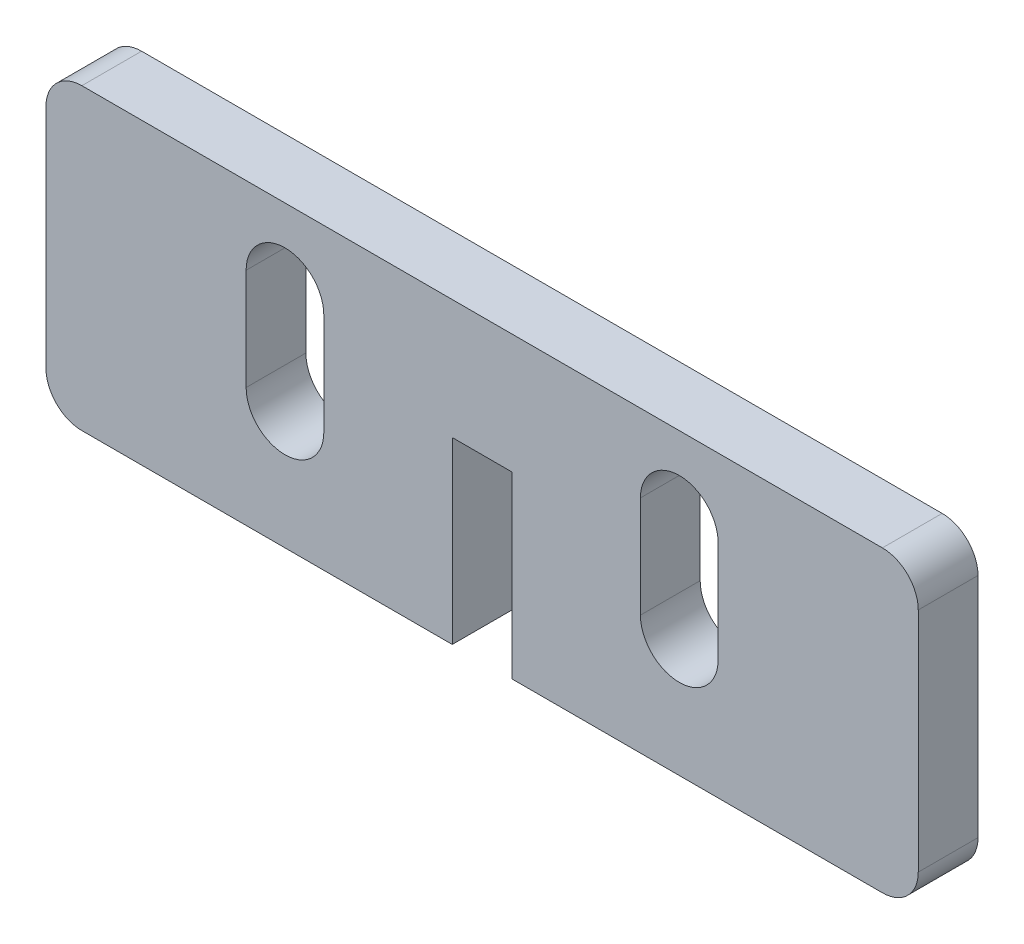
ISO-10303-21;
HEADER;
FILE_DESCRIPTION(('STEP AP214'),'2;1');
FILE_NAME('part.step','',(''),(''),'','','');
FILE_SCHEMA(('AUTOMOTIVE_DESIGN { 1 0 10303 214 1 1 1 1 }'));
ENDSEC;
DATA;
#1=APPLICATION_CONTEXT('core data for automotive mechanical design processes');
#2=APPLICATION_PROTOCOL_DEFINITION('international standard','automotive_design',2000,#1);
#3=PRODUCT_CONTEXT('',#1,'mechanical');
#4=PRODUCT('Part','Part','',(#3));
#5=PRODUCT_RELATED_PRODUCT_CATEGORY('part','',(#4));
#6=PRODUCT_DEFINITION_FORMATION('','',#4);
#7=PRODUCT_DEFINITION_CONTEXT('part definition',#1,'design');
#8=PRODUCT_DEFINITION('design','',#6,#7);
#9=PRODUCT_DEFINITION_SHAPE('','',#8);
#10=(LENGTH_UNIT() NAMED_UNIT(*) SI_UNIT(.MILLI.,.METRE.));
#11=(NAMED_UNIT(*) PLANE_ANGLE_UNIT() SI_UNIT($,.RADIAN.));
#12=(NAMED_UNIT(*) SI_UNIT($,.STERADIAN.) SOLID_ANGLE_UNIT());
#13=UNCERTAINTY_MEASURE_WITH_UNIT(LENGTH_MEASURE(1.E-05),#10,'distance_accuracy_value','');
#14=(GEOMETRIC_REPRESENTATION_CONTEXT(3) GLOBAL_UNCERTAINTY_ASSIGNED_CONTEXT((#13)) GLOBAL_UNIT_ASSIGNED_CONTEXT((#10,
#11,#12)) REPRESENTATION_CONTEXT('',''));
#15=CARTESIAN_POINT('',(0.,0.,0.));
#16=DIRECTION('',(0.,0.,1.));
#17=DIRECTION('',(1.,0.,0.));
#18=AXIS2_PLACEMENT_3D('',#15,#16,#17);
#19=CARTESIAN_POINT('',(33.5,-9.5,5.));
#20=DIRECTION('',(0.,0.,1.));
#21=DIRECTION('',(1.,0.,0.));
#22=AXIS2_PLACEMENT_3D('',#19,#20,#21);
#23=PLANE('',#22);
#24=DIRECTION('',(1.,0.,0.));
#25=VECTOR('',#24,1.);
#26=CARTESIAN_POINT('',(-33.5,-12.5,5.));
#27=LINE('',#26,#25);
#28=CARTESIAN_POINT('',(-33.5,-12.5,5.));
#29=VERTEX_POINT('',#28);
#30=CARTESIAN_POINT('',(-2.49999999999999,-12.5,5.));
#31=VERTEX_POINT('',#30);
#32=EDGE_CURVE('E239',#29,#31,#27,.T.);
#33=ORIENTED_EDGE('',*,*,#32,.T.);
#34=DIRECTION('',(0.,1.,0.));
#35=VECTOR('',#34,1.);
#36=CARTESIAN_POINT('',(-2.49999999999999,2.5,5.));
#37=LINE('',#36,#35);
#38=CARTESIAN_POINT('',(-2.49999999999999,2.5,5.));
#39=VERTEX_POINT('',#38);
#40=EDGE_CURVE('E242',#31,#39,#37,.T.);
#41=ORIENTED_EDGE('',*,*,#40,.T.);
#42=DIRECTION('',(1.,0.,0.));
#43=VECTOR('',#42,1.);
#44=CARTESIAN_POINT('',(2.50000000000001,2.5,5.));
#45=LINE('',#44,#43);
#46=CARTESIAN_POINT('',(2.50000000000001,2.5,5.));
#47=VERTEX_POINT('',#46);
#48=EDGE_CURVE('E245',#39,#47,#45,.T.);
#49=ORIENTED_EDGE('',*,*,#48,.T.);
#50=DIRECTION('',(0.,-1.,0.));
#51=VECTOR('',#50,1.);
#52=CARTESIAN_POINT('',(2.50000000000001,2.5,5.));
#53=LINE('',#52,#51);
#54=CARTESIAN_POINT('',(2.50000000000001,-12.5,5.));
#55=VERTEX_POINT('',#54);
#56=EDGE_CURVE('E247',#47,#55,#53,.T.);
#57=ORIENTED_EDGE('',*,*,#56,.T.);
#58=DIRECTION('',(1.,0.,0.));
#59=VECTOR('',#58,1.);
#60=CARTESIAN_POINT('',(2.50000000000001,-12.5,5.));
#61=LINE('',#60,#59);
#62=CARTESIAN_POINT('',(33.5,-12.5,5.));
#63=VERTEX_POINT('',#62);
#64=EDGE_CURVE('E249',#55,#63,#61,.T.);
#65=ORIENTED_EDGE('',*,*,#64,.T.);
#66=CARTESIAN_POINT('',(33.5,-9.5,5.));
#67=DIRECTION('',(0.,0.,1.));
#68=DIRECTION('',(1.,0.,0.));
#69=AXIS2_PLACEMENT_3D('',#66,#67,#68);
#70=CIRCLE('',#69,3.);
#71=CARTESIAN_POINT('',(36.5,-9.5,5.));
#72=VERTEX_POINT('',#71);
#73=EDGE_CURVE('E251',#63,#72,#70,.T.);
#74=ORIENTED_EDGE('',*,*,#73,.T.);
#75=DIRECTION('',(0.,1.,0.));
#76=VECTOR('',#75,1.);
#77=CARTESIAN_POINT('',(36.5,-9.49999999999998,5.));
#78=LINE('',#77,#76);
#79=CARTESIAN_POINT('',(36.5,9.49999999999998,5.));
#80=VERTEX_POINT('',#79);
#81=EDGE_CURVE('E253',#72,#80,#78,.T.);
#82=ORIENTED_EDGE('',*,*,#81,.T.);
#83=CARTESIAN_POINT('',(33.5,9.5,5.));
#84=DIRECTION('',(0.,0.,1.));
#85=DIRECTION('',(1.,0.,0.));
#86=AXIS2_PLACEMENT_3D('',#83,#84,#85);
#87=CIRCLE('',#86,3.);
#88=CARTESIAN_POINT('',(33.5,12.5,5.));
#89=VERTEX_POINT('',#88);
#90=EDGE_CURVE('E255',#80,#89,#87,.T.);
#91=ORIENTED_EDGE('',*,*,#90,.T.);
#92=DIRECTION('',(-1.,0.,0.));
#93=VECTOR('',#92,1.);
#94=CARTESIAN_POINT('',(33.5,12.5,5.));
#95=LINE('',#94,#93);
#96=CARTESIAN_POINT('',(-33.5,12.5,5.));
#97=VERTEX_POINT('',#96);
#98=EDGE_CURVE('E257',#89,#97,#95,.T.);
#99=ORIENTED_EDGE('',*,*,#98,.T.);
#100=CARTESIAN_POINT('',(-33.5,9.5,5.));
#101=DIRECTION('',(0.,0.,1.));
#102=DIRECTION('',(1.,0.,0.));
#103=AXIS2_PLACEMENT_3D('',#100,#101,#102);
#104=CIRCLE('',#103,3.);
#105=CARTESIAN_POINT('',(-36.5,9.49999999999998,5.));
#106=VERTEX_POINT('',#105);
#107=EDGE_CURVE('E259',#97,#106,#104,.T.);
#108=ORIENTED_EDGE('',*,*,#107,.T.);
#109=DIRECTION('',(0.,-1.,0.));
#110=VECTOR('',#109,1.);
#111=CARTESIAN_POINT('',(-36.5,-9.49999999999998,5.));
#112=LINE('',#111,#110);
#113=CARTESIAN_POINT('',(-36.5,-9.49999999999998,5.));
#114=VERTEX_POINT('',#113);
#115=EDGE_CURVE('E261',#106,#114,#112,.T.);
#116=ORIENTED_EDGE('',*,*,#115,.T.);
#117=CARTESIAN_POINT('',(-33.5,-9.5,5.));
#118=DIRECTION('',(0.,0.,1.));
#119=DIRECTION('',(-1.,0.,0.));
#120=AXIS2_PLACEMENT_3D('',#117,#118,#119);
#121=CIRCLE('',#120,3.);
#122=EDGE_CURVE('E263',#114,#29,#121,.T.);
#123=ORIENTED_EDGE('',*,*,#122,.T.);
#124=EDGE_LOOP('',(#33,#41,#49,#57,#65,#74,#82,#91,#99,#108,#116,#123));
#125=FACE_BOUND('',#124,.T.);
#126=DIRECTION('',(0.,1.,0.));
#127=VECTOR('',#126,1.);
#128=CARTESIAN_POINT('',(-13.25,-2.50000000000001,5.));
#129=LINE('',#128,#127);
#130=CARTESIAN_POINT('',(-13.25,-2.50000000000001,5.));
#131=VERTEX_POINT('',#130);
#132=CARTESIAN_POINT('',(-13.25,5.99999999999999,5.));
#133=VERTEX_POINT('',#132);
#134=EDGE_CURVE('E210',#131,#133,#129,.T.);
#135=ORIENTED_EDGE('',*,*,#134,.F.);
#136=CARTESIAN_POINT('',(-16.5,-2.50000000000001,5.));
#137=DIRECTION('',(0.,0.,1.));
#138=DIRECTION('',(1.,0.,0.));
#139=AXIS2_PLACEMENT_3D('',#136,#137,#138);
#140=CIRCLE('',#139,3.25);
#141=CARTESIAN_POINT('',(-19.75,-2.50000000000001,5.));
#142=VERTEX_POINT('',#141);
#143=EDGE_CURVE('E208',#142,#131,#140,.T.);
#144=ORIENTED_EDGE('',*,*,#143,.F.);
#145=DIRECTION('',(0.,-1.,0.));
#146=VECTOR('',#145,1.);
#147=CARTESIAN_POINT('',(-19.75,-2.50000000000001,5.));
#148=LINE('',#147,#146);
#149=CARTESIAN_POINT('',(-19.75,5.99999999999999,5.));
#150=VERTEX_POINT('',#149);
#151=EDGE_CURVE('E216',#150,#142,#148,.T.);
#152=ORIENTED_EDGE('',*,*,#151,.F.);
#153=CARTESIAN_POINT('',(-16.5,5.99999999999999,5.));
#154=DIRECTION('',(0.,0.,1.));
#155=DIRECTION('',(1.,0.,0.));
#156=AXIS2_PLACEMENT_3D('',#153,#154,#155);
#157=CIRCLE('',#156,3.25);
#158=EDGE_CURVE('E213',#133,#150,#157,.T.);
#159=ORIENTED_EDGE('',*,*,#158,.F.);
#160=EDGE_LOOP('',(#135,#144,#152,#159));
#161=FACE_BOUND('',#160,.T.);
#162=DIRECTION('',(0.,1.,0.));
#163=VECTOR('',#162,1.);
#164=CARTESIAN_POINT('',(19.75,-2.5,5.));
#165=LINE('',#164,#163);
#166=CARTESIAN_POINT('',(19.75,-2.5,5.));
#167=VERTEX_POINT('',#166);
#168=CARTESIAN_POINT('',(19.75,6.,5.));
#169=VERTEX_POINT('',#168);
#170=EDGE_CURVE('E180',#167,#169,#165,.T.);
#171=ORIENTED_EDGE('',*,*,#170,.F.);
#172=CARTESIAN_POINT('',(16.5,-2.5,5.));
#173=DIRECTION('',(0.,0.,1.));
#174=DIRECTION('',(-1.,0.,0.));
#175=AXIS2_PLACEMENT_3D('',#172,#173,#174);
#176=CIRCLE('',#175,3.25);
#177=CARTESIAN_POINT('',(13.25,-2.5,5.));
#178=VERTEX_POINT('',#177);
#179=EDGE_CURVE('E172',#178,#167,#176,.T.);
#180=ORIENTED_EDGE('',*,*,#179,.F.);
#181=DIRECTION('',(0.,-1.,0.));
#182=VECTOR('',#181,1.);
#183=CARTESIAN_POINT('',(13.25,-2.5,5.));
#184=LINE('',#183,#182);
#185=CARTESIAN_POINT('',(13.25,6.,5.));
#186=VERTEX_POINT('',#185);
#187=EDGE_CURVE('E194',#186,#178,#184,.T.);
#188=ORIENTED_EDGE('',*,*,#187,.F.);
#189=CARTESIAN_POINT('',(16.5,6.,5.));
#190=DIRECTION('',(0.,0.,1.));
#191=DIRECTION('',(-1.,0.,0.));
#192=AXIS2_PLACEMENT_3D('',#189,#190,#191);
#193=CIRCLE('',#192,3.25);
#194=EDGE_CURVE('E192',#169,#186,#193,.T.);
#195=ORIENTED_EDGE('',*,*,#194,.F.);
#196=EDGE_LOOP('',(#171,#180,#188,#195));
#197=FACE_BOUND('',#196,.T.);
#198=ADVANCED_FACE('F35',(#125,#161,#197),#23,.T.);
#199=CARTESIAN_POINT('',(33.5,-9.5,0.));
#200=DIRECTION('',(0.,0.,1.));
#201=DIRECTION('',(1.,0.,0.));
#202=AXIS2_PLACEMENT_3D('',#199,#200,#201);
#203=PLANE('',#202);
#204=CARTESIAN_POINT('',(-16.5,-2.50000000000001,0.));
#205=DIRECTION('',(0.,0.,1.));
#206=DIRECTION('',(1.,0.,0.));
#207=AXIS2_PLACEMENT_3D('',#204,#205,#206);
#208=CIRCLE('',#207,3.25);
#209=CARTESIAN_POINT('',(-19.75,-2.50000000000001,0.));
#210=VERTEX_POINT('',#209);
#211=CARTESIAN_POINT('',(-13.25,-2.50000000000001,0.));
#212=VERTEX_POINT('',#211);
#213=EDGE_CURVE('E188',#210,#212,#208,.T.);
#214=ORIENTED_EDGE('',*,*,#213,.T.);
#215=DIRECTION('',(0.,1.,0.));
#216=VECTOR('',#215,1.);
#217=CARTESIAN_POINT('',(-13.25,-2.50000000000001,0.));
#218=LINE('',#217,#216);
#219=CARTESIAN_POINT('',(-13.25,5.99999999999999,0.));
#220=VERTEX_POINT('',#219);
#221=EDGE_CURVE('E221',#212,#220,#218,.T.);
#222=ORIENTED_EDGE('',*,*,#221,.T.);
#223=CARTESIAN_POINT('',(-16.5,5.99999999999999,0.));
#224=DIRECTION('',(0.,0.,1.));
#225=DIRECTION('',(1.,0.,0.));
#226=AXIS2_PLACEMENT_3D('',#223,#224,#225);
#227=CIRCLE('',#226,3.25);
#228=CARTESIAN_POINT('',(-19.75,5.99999999999999,0.));
#229=VERTEX_POINT('',#228);
#230=EDGE_CURVE('E224',#220,#229,#227,.T.);
#231=ORIENTED_EDGE('',*,*,#230,.T.);
#232=DIRECTION('',(0.,-1.,0.));
#233=VECTOR('',#232,1.);
#234=CARTESIAN_POINT('',(-19.75,-2.50000000000001,0.));
#235=LINE('',#234,#233);
#236=EDGE_CURVE('E211',#229,#210,#235,.T.);
#237=ORIENTED_EDGE('',*,*,#236,.T.);
#238=EDGE_LOOP('',(#214,#222,#231,#237));
#239=FACE_BOUND('',#238,.T.);
#240=DIRECTION('',(1.,0.,0.));
#241=VECTOR('',#240,1.);
#242=CARTESIAN_POINT('',(-33.5,-12.5,0.));
#243=LINE('',#242,#241);
#244=CARTESIAN_POINT('',(-33.5,-12.5,0.));
#245=VERTEX_POINT('',#244);
#246=CARTESIAN_POINT('',(-2.49999999999999,-12.5,0.));
#247=VERTEX_POINT('',#246);
#248=EDGE_CURVE('E238',#245,#247,#243,.T.);
#249=ORIENTED_EDGE('',*,*,#248,.F.);
#250=CARTESIAN_POINT('',(-33.5,-9.5,0.));
#251=DIRECTION('',(0.,0.,1.));
#252=DIRECTION('',(-1.,0.,0.));
#253=AXIS2_PLACEMENT_3D('',#250,#251,#252);
#254=CIRCLE('',#253,3.);
#255=CARTESIAN_POINT('',(-36.5,-9.49999999999998,0.));
#256=VERTEX_POINT('',#255);
#257=EDGE_CURVE('E243',#256,#245,#254,.T.);
#258=ORIENTED_EDGE('',*,*,#257,.F.);
#259=DIRECTION('',(0.,-1.,0.));
#260=VECTOR('',#259,1.);
#261=CARTESIAN_POINT('',(-36.5,-9.49999999999998,0.));
#262=LINE('',#261,#260);
#263=CARTESIAN_POINT('',(-36.5,9.49999999999998,0.));
#264=VERTEX_POINT('',#263);
#265=EDGE_CURVE('E286',#264,#256,#262,.T.);
#266=ORIENTED_EDGE('',*,*,#265,.F.);
#267=CARTESIAN_POINT('',(-33.5,9.5,0.));
#268=DIRECTION('',(0.,0.,1.));
#269=DIRECTION('',(1.,0.,0.));
#270=AXIS2_PLACEMENT_3D('',#267,#268,#269);
#271=CIRCLE('',#270,3.);
#272=CARTESIAN_POINT('',(-33.5,12.5,0.));
#273=VERTEX_POINT('',#272);
#274=EDGE_CURVE('E284',#273,#264,#271,.T.);
#275=ORIENTED_EDGE('',*,*,#274,.F.);
#276=DIRECTION('',(-1.,0.,0.));
#277=VECTOR('',#276,1.);
#278=CARTESIAN_POINT('',(33.5,12.5,0.));
#279=LINE('',#278,#277);
#280=CARTESIAN_POINT('',(33.5,12.5,0.));
#281=VERTEX_POINT('',#280);
#282=EDGE_CURVE('E282',#281,#273,#279,.T.);
#283=ORIENTED_EDGE('',*,*,#282,.F.);
#284=CARTESIAN_POINT('',(33.5,9.5,0.));
#285=DIRECTION('',(0.,0.,1.));
#286=DIRECTION('',(1.,0.,0.));
#287=AXIS2_PLACEMENT_3D('',#284,#285,#286);
#288=CIRCLE('',#287,3.);
#289=CARTESIAN_POINT('',(36.5,9.49999999999998,0.));
#290=VERTEX_POINT('',#289);
#291=EDGE_CURVE('E280',#290,#281,#288,.T.);
#292=ORIENTED_EDGE('',*,*,#291,.F.);
#293=DIRECTION('',(0.,1.,0.));
#294=VECTOR('',#293,1.);
#295=CARTESIAN_POINT('',(36.5,-9.49999999999998,0.));
#296=LINE('',#295,#294);
#297=CARTESIAN_POINT('',(36.5,-9.5,0.));
#298=VERTEX_POINT('',#297);
#299=EDGE_CURVE('E278',#298,#290,#296,.T.);
#300=ORIENTED_EDGE('',*,*,#299,.F.);
#301=CARTESIAN_POINT('',(33.5,-9.5,0.));
#302=DIRECTION('',(0.,0.,1.));
#303=DIRECTION('',(1.,0.,0.));
#304=AXIS2_PLACEMENT_3D('',#301,#302,#303);
#305=CIRCLE('',#304,3.);
#306=CARTESIAN_POINT('',(33.5,-12.5,0.));
#307=VERTEX_POINT('',#306);
#308=EDGE_CURVE('E276',#307,#298,#305,.T.);
#309=ORIENTED_EDGE('',*,*,#308,.F.);
#310=DIRECTION('',(1.,0.,0.));
#311=VECTOR('',#310,1.);
#312=CARTESIAN_POINT('',(2.50000000000001,-12.5,0.));
#313=LINE('',#312,#311);
#314=CARTESIAN_POINT('',(2.50000000000001,-12.5,0.));
#315=VERTEX_POINT('',#314);
#316=EDGE_CURVE('E274',#315,#307,#313,.T.);
#317=ORIENTED_EDGE('',*,*,#316,.F.);
#318=DIRECTION('',(0.,-1.,0.));
#319=VECTOR('',#318,1.);
#320=CARTESIAN_POINT('',(2.50000000000001,2.5,0.));
#321=LINE('',#320,#319);
#322=CARTESIAN_POINT('',(2.50000000000001,2.5,0.));
#323=VERTEX_POINT('',#322);
#324=EDGE_CURVE('E272',#323,#315,#321,.T.);
#325=ORIENTED_EDGE('',*,*,#324,.F.);
#326=DIRECTION('',(1.,0.,0.));
#327=VECTOR('',#326,1.);
#328=CARTESIAN_POINT('',(2.50000000000001,2.5,0.));
#329=LINE('',#328,#327);
#330=CARTESIAN_POINT('',(-2.49999999999999,2.5,0.));
#331=VERTEX_POINT('',#330);
#332=EDGE_CURVE('E270',#331,#323,#329,.T.);
#333=ORIENTED_EDGE('',*,*,#332,.F.);
#334=DIRECTION('',(0.,1.,0.));
#335=VECTOR('',#334,1.);
#336=CARTESIAN_POINT('',(-2.49999999999999,2.5,0.));
#337=LINE('',#336,#335);
#338=EDGE_CURVE('E268',#247,#331,#337,.T.);
#339=ORIENTED_EDGE('',*,*,#338,.F.);
#340=EDGE_LOOP('',(#249,#258,#266,#275,#283,#292,#300,#309,#317,#325,#333,#339));
#341=FACE_BOUND('',#340,.T.);
#342=CARTESIAN_POINT('',(16.5,-2.5,0.));
#343=DIRECTION('',(0.,0.,1.));
#344=DIRECTION('',(-1.,0.,0.));
#345=AXIS2_PLACEMENT_3D('',#342,#343,#344);
#346=CIRCLE('',#345,3.25);
#347=CARTESIAN_POINT('',(13.25,-2.5,0.));
#348=VERTEX_POINT('',#347);
#349=CARTESIAN_POINT('',(19.75,-2.5,0.));
#350=VERTEX_POINT('',#349);
#351=EDGE_CURVE('E58',#348,#350,#346,.T.);
#352=ORIENTED_EDGE('',*,*,#351,.T.);
#353=DIRECTION('',(0.,1.,0.));
#354=VECTOR('',#353,1.);
#355=CARTESIAN_POINT('',(19.75,-2.5,0.));
#356=LINE('',#355,#354);
#357=CARTESIAN_POINT('',(19.75,6.,0.));
#358=VERTEX_POINT('',#357);
#359=EDGE_CURVE('E187',#350,#358,#356,.T.);
#360=ORIENTED_EDGE('',*,*,#359,.T.);
#361=CARTESIAN_POINT('',(16.5,6.,0.));
#362=DIRECTION('',(0.,0.,1.));
#363=DIRECTION('',(-1.,0.,0.));
#364=AXIS2_PLACEMENT_3D('',#361,#362,#363);
#365=CIRCLE('',#364,3.25);
#366=CARTESIAN_POINT('',(13.25,6.,0.));
#367=VERTEX_POINT('',#366);
#368=EDGE_CURVE('E200',#358,#367,#365,.T.);
#369=ORIENTED_EDGE('',*,*,#368,.T.);
#370=DIRECTION('',(0.,-1.,0.));
#371=VECTOR('',#370,1.);
#372=CARTESIAN_POINT('',(13.25,-2.5,0.));
#373=LINE('',#372,#371);
#374=EDGE_CURVE('E181',#367,#348,#373,.T.);
#375=ORIENTED_EDGE('',*,*,#374,.T.);
#376=EDGE_LOOP('',(#352,#360,#369,#375));
#377=FACE_BOUND('',#376,.T.);
#378=ADVANCED_FACE('F328',(#239,#341,#377),#203,.F.);
#379=CARTESIAN_POINT('',(-33.5,-12.5,5.));
#380=DIRECTION('',(0.,1.,0.));
#381=DIRECTION('',(0.,0.,1.));
#382=AXIS2_PLACEMENT_3D('',#379,#380,#381);
#383=PLANE('',#382);
#384=ORIENTED_EDGE('',*,*,#248,.T.);
#385=DIRECTION('',(0.,0.,-1.));
#386=VECTOR('',#385,1.);
#387=CARTESIAN_POINT('',(-2.49999999999999,-12.5,5.));
#388=LINE('',#387,#386);
#389=EDGE_CURVE('E11',#31,#247,#388,.T.);
#390=ORIENTED_EDGE('',*,*,#389,.F.);
#391=ORIENTED_EDGE('',*,*,#32,.F.);
#392=DIRECTION('',(0.,0.,-1.));
#393=VECTOR('',#392,1.);
#394=CARTESIAN_POINT('',(-33.5,-12.5,5.));
#395=LINE('',#394,#393);
#396=EDGE_CURVE('E265',#29,#245,#395,.T.);
#397=ORIENTED_EDGE('',*,*,#396,.T.);
#398=EDGE_LOOP('',(#384,#390,#391,#397));
#399=FACE_BOUND('',#398,.T.);
#400=ADVANCED_FACE('F37',(#399),#383,.F.);
#401=CARTESIAN_POINT('',(-2.49999999999999,2.5,5.));
#402=DIRECTION('',(-1.,0.,0.));
#403=DIRECTION('',(0.,-1.,0.));
#404=AXIS2_PLACEMENT_3D('',#401,#402,#403);
#405=PLANE('',#404);
#406=ORIENTED_EDGE('',*,*,#338,.T.);
#407=DIRECTION('',(0.,0.,-1.));
#408=VECTOR('',#407,1.);
#409=CARTESIAN_POINT('',(-2.49999999999999,2.5,5.));
#410=LINE('',#409,#408);
#411=EDGE_CURVE('E43',#39,#331,#410,.T.);
#412=ORIENTED_EDGE('',*,*,#411,.F.);
#413=ORIENTED_EDGE('',*,*,#40,.F.);
#414=ORIENTED_EDGE('',*,*,#389,.T.);
#415=EDGE_LOOP('',(#406,#412,#413,#414));
#416=FACE_BOUND('',#415,.T.);
#417=ADVANCED_FACE('F346',(#416),#405,.F.);
#418=CARTESIAN_POINT('',(2.50000000000001,2.5,5.));
#419=DIRECTION('',(0.,1.,0.));
#420=DIRECTION('',(0.,0.,1.));
#421=AXIS2_PLACEMENT_3D('',#418,#419,#420);
#422=PLANE('',#421);
#423=ORIENTED_EDGE('',*,*,#332,.T.);
#424=DIRECTION('',(0.,0.,-1.));
#425=VECTOR('',#424,1.);
#426=CARTESIAN_POINT('',(2.50000000000001,2.5,5.));
#427=LINE('',#426,#425);
#428=EDGE_CURVE('E315',#47,#323,#427,.T.);
#429=ORIENTED_EDGE('',*,*,#428,.F.);
#430=ORIENTED_EDGE('',*,*,#48,.F.);
#431=ORIENTED_EDGE('',*,*,#411,.T.);
#432=EDGE_LOOP('',(#423,#429,#430,#431));
#433=FACE_BOUND('',#432,.T.);
#434=ADVANCED_FACE('F322',(#433),#422,.F.);
#435=CARTESIAN_POINT('',(2.50000000000001,2.5,5.));
#436=DIRECTION('',(1.,0.,0.));
#437=DIRECTION('',(0.,1.,0.));
#438=AXIS2_PLACEMENT_3D('',#435,#436,#437);
#439=PLANE('',#438);
#440=ORIENTED_EDGE('',*,*,#324,.T.);
#441=DIRECTION('',(0.,0.,-1.));
#442=VECTOR('',#441,1.);
#443=CARTESIAN_POINT('',(2.50000000000001,-12.5,5.));
#444=LINE('',#443,#442);
#445=EDGE_CURVE('E312',#55,#315,#444,.T.);
#446=ORIENTED_EDGE('',*,*,#445,.F.);
#447=ORIENTED_EDGE('',*,*,#56,.F.);
#448=ORIENTED_EDGE('',*,*,#428,.T.);
#449=EDGE_LOOP('',(#440,#446,#447,#448));
#450=FACE_BOUND('',#449,.T.);
#451=ADVANCED_FACE('F334',(#450),#439,.F.);
#452=CARTESIAN_POINT('',(2.50000000000001,-12.5,5.));
#453=DIRECTION('',(0.,1.,0.));
#454=DIRECTION('',(-1.,0.,0.));
#455=AXIS2_PLACEMENT_3D('',#452,#453,#454);
#456=PLANE('',#455);
#457=ORIENTED_EDGE('',*,*,#316,.T.);
#458=DIRECTION('',(0.,0.,-1.));
#459=VECTOR('',#458,1.);
#460=CARTESIAN_POINT('',(33.5,-12.5,5.));
#461=LINE('',#460,#459);
#462=EDGE_CURVE('E309',#63,#307,#461,.T.);
#463=ORIENTED_EDGE('',*,*,#462,.F.);
#464=ORIENTED_EDGE('',*,*,#64,.F.);
#465=ORIENTED_EDGE('',*,*,#445,.T.);
#466=EDGE_LOOP('',(#457,#463,#464,#465));
#467=FACE_BOUND('',#466,.T.);
#468=ADVANCED_FACE('F338',(#467),#456,.F.);
#469=CARTESIAN_POINT('',(33.5,-9.5,5.));
#470=DIRECTION('',(0.,0.,-1.));
#471=DIRECTION('',(-1.,0.,0.));
#472=AXIS2_PLACEMENT_3D('',#469,#470,#471);
#473=CYLINDRICAL_SURFACE('',#472,3.);
#474=ORIENTED_EDGE('',*,*,#308,.T.);
#475=DIRECTION('',(0.,0.,-1.));
#476=VECTOR('',#475,1.);
#477=CARTESIAN_POINT('',(36.5,-9.5,5.));
#478=LINE('',#477,#476);
#479=EDGE_CURVE('E306',#72,#298,#478,.T.);
#480=ORIENTED_EDGE('',*,*,#479,.F.);
#481=ORIENTED_EDGE('',*,*,#73,.F.);
#482=ORIENTED_EDGE('',*,*,#462,.T.);
#483=EDGE_LOOP('',(#474,#480,#481,#482));
#484=FACE_BOUND('',#483,.T.);
#485=ADVANCED_FACE('F379',(#484),#473,.T.);
#486=CARTESIAN_POINT('',(36.5,-9.49999999999998,5.));
#487=DIRECTION('',(-1.,0.,0.));
#488=DIRECTION('',(0.,0.,1.));
#489=AXIS2_PLACEMENT_3D('',#486,#487,#488);
#490=PLANE('',#489);
#491=ORIENTED_EDGE('',*,*,#299,.T.);
#492=DIRECTION('',(0.,0.,-1.));
#493=VECTOR('',#492,1.);
#494=CARTESIAN_POINT('',(36.5,9.49999999999998,5.));
#495=LINE('',#494,#493);
#496=EDGE_CURVE('E303',#80,#290,#495,.T.);
#497=ORIENTED_EDGE('',*,*,#496,.F.);
#498=ORIENTED_EDGE('',*,*,#81,.F.);
#499=ORIENTED_EDGE('',*,*,#479,.T.);
#500=EDGE_LOOP('',(#491,#497,#498,#499));
#501=FACE_BOUND('',#500,.T.);
#502=ADVANCED_FACE('F377',(#501),#490,.F.);
#503=CARTESIAN_POINT('',(33.5,9.5,5.));
#504=DIRECTION('',(0.,0.,-1.));
#505=DIRECTION('',(-1.,0.,0.));
#506=AXIS2_PLACEMENT_3D('',#503,#504,#505);
#507=CYLINDRICAL_SURFACE('',#506,3.);
#508=ORIENTED_EDGE('',*,*,#291,.T.);
#509=DIRECTION('',(0.,0.,-1.));
#510=VECTOR('',#509,1.);
#511=CARTESIAN_POINT('',(33.5,12.5,5.));
#512=LINE('',#511,#510);
#513=EDGE_CURVE('E300',#89,#281,#512,.T.);
#514=ORIENTED_EDGE('',*,*,#513,.F.);
#515=ORIENTED_EDGE('',*,*,#90,.F.);
#516=ORIENTED_EDGE('',*,*,#496,.T.);
#517=EDGE_LOOP('',(#508,#514,#515,#516));
#518=FACE_BOUND('',#517,.T.);
#519=ADVANCED_FACE('F373',(#518),#507,.T.);
#520=CARTESIAN_POINT('',(33.5,12.5,5.));
#521=DIRECTION('',(0.,-1.,0.));
#522=DIRECTION('',(0.,0.,-1.));
#523=AXIS2_PLACEMENT_3D('',#520,#521,#522);
#524=PLANE('',#523);
#525=ORIENTED_EDGE('',*,*,#282,.T.);
#526=DIRECTION('',(0.,0.,-1.));
#527=VECTOR('',#526,1.);
#528=CARTESIAN_POINT('',(-33.5,12.5,5.));
#529=LINE('',#528,#527);
#530=EDGE_CURVE('E297',#97,#273,#529,.T.);
#531=ORIENTED_EDGE('',*,*,#530,.F.);
#532=ORIENTED_EDGE('',*,*,#98,.F.);
#533=ORIENTED_EDGE('',*,*,#513,.T.);
#534=EDGE_LOOP('',(#525,#531,#532,#533));
#535=FACE_BOUND('',#534,.T.);
#536=ADVANCED_FACE('F368',(#535),#524,.F.);
#537=CARTESIAN_POINT('',(-33.5,9.5,5.));
#538=DIRECTION('',(0.,0.,-1.));
#539=DIRECTION('',(-1.,0.,0.));
#540=AXIS2_PLACEMENT_3D('',#537,#538,#539);
#541=CYLINDRICAL_SURFACE('',#540,3.);
#542=ORIENTED_EDGE('',*,*,#274,.T.);
#543=DIRECTION('',(0.,0.,-1.));
#544=VECTOR('',#543,1.);
#545=CARTESIAN_POINT('',(-36.5,9.49999999999998,5.));
#546=LINE('',#545,#544);
#547=EDGE_CURVE('E294',#106,#264,#546,.T.);
#548=ORIENTED_EDGE('',*,*,#547,.F.);
#549=ORIENTED_EDGE('',*,*,#107,.F.);
#550=ORIENTED_EDGE('',*,*,#530,.T.);
#551=EDGE_LOOP('',(#542,#548,#549,#550));
#552=FACE_BOUND('',#551,.T.);
#553=ADVANCED_FACE('F362',(#552),#541,.T.);
#554=CARTESIAN_POINT('',(-36.5,-9.49999999999998,5.));
#555=DIRECTION('',(1.,0.,0.));
#556=DIRECTION('',(0.,0.,-1.));
#557=AXIS2_PLACEMENT_3D('',#554,#555,#556);
#558=PLANE('',#557);
#559=ORIENTED_EDGE('',*,*,#265,.T.);
#560=DIRECTION('',(0.,0.,-1.));
#561=VECTOR('',#560,1.);
#562=CARTESIAN_POINT('',(-36.5,-9.49999999999998,5.));
#563=LINE('',#562,#561);
#564=EDGE_CURVE('E291',#114,#256,#563,.T.);
#565=ORIENTED_EDGE('',*,*,#564,.F.);
#566=ORIENTED_EDGE('',*,*,#115,.F.);
#567=ORIENTED_EDGE('',*,*,#547,.T.);
#568=EDGE_LOOP('',(#559,#565,#566,#567));
#569=FACE_BOUND('',#568,.T.);
#570=ADVANCED_FACE('F358',(#569),#558,.F.);
#571=CARTESIAN_POINT('',(-33.5,-9.5,5.));
#572=DIRECTION('',(0.,0.,-1.));
#573=DIRECTION('',(-1.,0.,0.));
#574=AXIS2_PLACEMENT_3D('',#571,#572,#573);
#575=CYLINDRICAL_SURFACE('',#574,3.);
#576=ORIENTED_EDGE('',*,*,#257,.T.);
#577=ORIENTED_EDGE('',*,*,#396,.F.);
#578=ORIENTED_EDGE('',*,*,#122,.F.);
#579=ORIENTED_EDGE('',*,*,#564,.T.);
#580=EDGE_LOOP('',(#576,#577,#578,#579));
#581=FACE_BOUND('',#580,.T.);
#582=ADVANCED_FACE('F353',(#581),#575,.T.);
#583=CARTESIAN_POINT('',(-16.5,-2.50000000000001,5.));
#584=DIRECTION('',(0.,0.,-1.));
#585=DIRECTION('',(-1.,0.,0.));
#586=AXIS2_PLACEMENT_3D('',#583,#584,#585);
#587=CYLINDRICAL_SURFACE('',#586,3.25);
#588=ORIENTED_EDGE('',*,*,#213,.F.);
#589=DIRECTION('',(0.,0.,-1.));
#590=VECTOR('',#589,1.);
#591=CARTESIAN_POINT('',(-19.75,-2.50000000000001,5.));
#592=LINE('',#591,#590);
#593=EDGE_CURVE('E218',#142,#210,#592,.T.);
#594=ORIENTED_EDGE('',*,*,#593,.F.);
#595=ORIENTED_EDGE('',*,*,#143,.T.);
#596=DIRECTION('',(0.,0.,-1.));
#597=VECTOR('',#596,1.);
#598=CARTESIAN_POINT('',(-13.25,-2.50000000000001,5.));
#599=LINE('',#598,#597);
#600=EDGE_CURVE('E235',#131,#212,#599,.T.);
#601=ORIENTED_EDGE('',*,*,#600,.T.);
#602=EDGE_LOOP('',(#588,#594,#595,#601));
#603=FACE_BOUND('',#602,.T.);
#604=ADVANCED_FACE('F396',(#603),#587,.F.);
#605=CARTESIAN_POINT('',(-13.25,-2.50000000000001,5.));
#606=DIRECTION('',(-1.,0.,0.));
#607=DIRECTION('',(0.,-1.,0.));
#608=AXIS2_PLACEMENT_3D('',#605,#606,#607);
#609=PLANE('',#608);
#610=ORIENTED_EDGE('',*,*,#221,.F.);
#611=ORIENTED_EDGE('',*,*,#600,.F.);
#612=ORIENTED_EDGE('',*,*,#134,.T.);
#613=DIRECTION('',(0.,0.,-1.));
#614=VECTOR('',#613,1.);
#615=CARTESIAN_POINT('',(-13.25,5.99999999999999,5.));
#616=LINE('',#615,#614);
#617=EDGE_CURVE('E233',#133,#220,#616,.T.);
#618=ORIENTED_EDGE('',*,*,#617,.T.);
#619=EDGE_LOOP('',(#610,#611,#612,#618));
#620=FACE_BOUND('',#619,.T.);
#621=ADVANCED_FACE('F434',(#620),#609,.T.);
#622=CARTESIAN_POINT('',(-16.5,5.99999999999999,5.));
#623=DIRECTION('',(0.,0.,-1.));
#624=DIRECTION('',(-1.,0.,0.));
#625=AXIS2_PLACEMENT_3D('',#622,#623,#624);
#626=CYLINDRICAL_SURFACE('',#625,3.25);
#627=ORIENTED_EDGE('',*,*,#230,.F.);
#628=ORIENTED_EDGE('',*,*,#617,.F.);
#629=ORIENTED_EDGE('',*,*,#158,.T.);
#630=DIRECTION('',(0.,0.,-1.));
#631=VECTOR('',#630,1.);
#632=CARTESIAN_POINT('',(-19.75,5.99999999999999,5.));
#633=LINE('',#632,#631);
#634=EDGE_CURVE('E231',#150,#229,#633,.T.);
#635=ORIENTED_EDGE('',*,*,#634,.T.);
#636=EDGE_LOOP('',(#627,#628,#629,#635));
#637=FACE_BOUND('',#636,.T.);
#638=ADVANCED_FACE('F441',(#637),#626,.F.);
#639=CARTESIAN_POINT('',(-19.75,-2.50000000000001,5.));
#640=DIRECTION('',(1.,0.,0.));
#641=DIRECTION('',(0.,1.,0.));
#642=AXIS2_PLACEMENT_3D('',#639,#640,#641);
#643=PLANE('',#642);
#644=ORIENTED_EDGE('',*,*,#236,.F.);
#645=ORIENTED_EDGE('',*,*,#634,.F.);
#646=ORIENTED_EDGE('',*,*,#151,.T.);
#647=ORIENTED_EDGE('',*,*,#593,.T.);
#648=EDGE_LOOP('',(#644,#645,#646,#647));
#649=FACE_BOUND('',#648,.T.);
#650=ADVANCED_FACE('F448',(#649),#643,.T.);
#651=CARTESIAN_POINT('',(16.5,-2.5,5.));
#652=DIRECTION('',(0.,0.,-1.));
#653=DIRECTION('',(-1.,0.,0.));
#654=AXIS2_PLACEMENT_3D('',#651,#652,#653);
#655=CYLINDRICAL_SURFACE('',#654,3.25);
#656=ORIENTED_EDGE('',*,*,#351,.F.);
#657=DIRECTION('',(0.,0.,-1.));
#658=VECTOR('',#657,1.);
#659=CARTESIAN_POINT('',(13.25,-2.5,5.));
#660=LINE('',#659,#658);
#661=EDGE_CURVE('E176',#178,#348,#660,.T.);
#662=ORIENTED_EDGE('',*,*,#661,.F.);
#663=ORIENTED_EDGE('',*,*,#179,.T.);
#664=DIRECTION('',(0.,0.,-1.));
#665=VECTOR('',#664,1.);
#666=CARTESIAN_POINT('',(19.75,-2.5,5.));
#667=LINE('',#666,#665);
#668=EDGE_CURVE('E175',#167,#350,#667,.T.);
#669=ORIENTED_EDGE('',*,*,#668,.T.);
#670=EDGE_LOOP('',(#656,#662,#663,#669));
#671=FACE_BOUND('',#670,.T.);
#672=ADVANCED_FACE('F174',(#671),#655,.F.);
#673=CARTESIAN_POINT('',(19.75,-2.5,5.));
#674=DIRECTION('',(-1.,0.,0.));
#675=DIRECTION('',(0.,-1.,0.));
#676=AXIS2_PLACEMENT_3D('',#673,#674,#675);
#677=PLANE('',#676);
#678=ORIENTED_EDGE('',*,*,#359,.F.);
#679=ORIENTED_EDGE('',*,*,#668,.F.);
#680=ORIENTED_EDGE('',*,*,#170,.T.);
#681=DIRECTION('',(0.,0.,-1.));
#682=VECTOR('',#681,1.);
#683=CARTESIAN_POINT('',(19.75,6.,5.));
#684=LINE('',#683,#682);
#685=EDGE_CURVE('E189',#169,#358,#684,.T.);
#686=ORIENTED_EDGE('',*,*,#685,.T.);
#687=EDGE_LOOP('',(#678,#679,#680,#686));
#688=FACE_BOUND('',#687,.T.);
#689=ADVANCED_FACE('F184',(#688),#677,.T.);
#690=CARTESIAN_POINT('',(16.5,6.,5.));
#691=DIRECTION('',(0.,0.,-1.));
#692=DIRECTION('',(-1.,0.,0.));
#693=AXIS2_PLACEMENT_3D('',#690,#691,#692);
#694=CYLINDRICAL_SURFACE('',#693,3.25);
#695=ORIENTED_EDGE('',*,*,#368,.F.);
#696=ORIENTED_EDGE('',*,*,#685,.F.);
#697=ORIENTED_EDGE('',*,*,#194,.T.);
#698=DIRECTION('',(0.,0.,-1.));
#699=VECTOR('',#698,1.);
#700=CARTESIAN_POINT('',(13.25,6.,5.));
#701=LINE('',#700,#699);
#702=EDGE_CURVE('E50',#186,#367,#701,.T.);
#703=ORIENTED_EDGE('',*,*,#702,.T.);
#704=EDGE_LOOP('',(#695,#696,#697,#703));
#705=FACE_BOUND('',#704,.T.);
#706=ADVANCED_FACE('F469',(#705),#694,.F.);
#707=CARTESIAN_POINT('',(13.25,-2.5,5.));
#708=DIRECTION('',(1.,0.,0.));
#709=DIRECTION('',(0.,0.,-1.));
#710=AXIS2_PLACEMENT_3D('',#707,#708,#709);
#711=PLANE('',#710);
#712=ORIENTED_EDGE('',*,*,#374,.F.);
#713=ORIENTED_EDGE('',*,*,#702,.F.);
#714=ORIENTED_EDGE('',*,*,#187,.T.);
#715=ORIENTED_EDGE('',*,*,#661,.T.);
#716=EDGE_LOOP('',(#712,#713,#714,#715));
#717=FACE_BOUND('',#716,.T.);
#718=ADVANCED_FACE('F476',(#717),#711,.T.);
#719=CLOSED_SHELL('',(#198,#378,#400,#417,#434,#451,#468,#485,#502,#519,#536,#553,#570,#582,
#604,#621,#638,#650,#672,#689,#706,#718));
#720=MANIFOLD_SOLID_BREP('B2',#719);
#721=ADVANCED_BREP_SHAPE_REPRESENTATION('',(#18,#720),#14);
#722=SHAPE_DEFINITION_REPRESENTATION(#9,#721);
ENDSEC;
END-ISO-10303-21;
